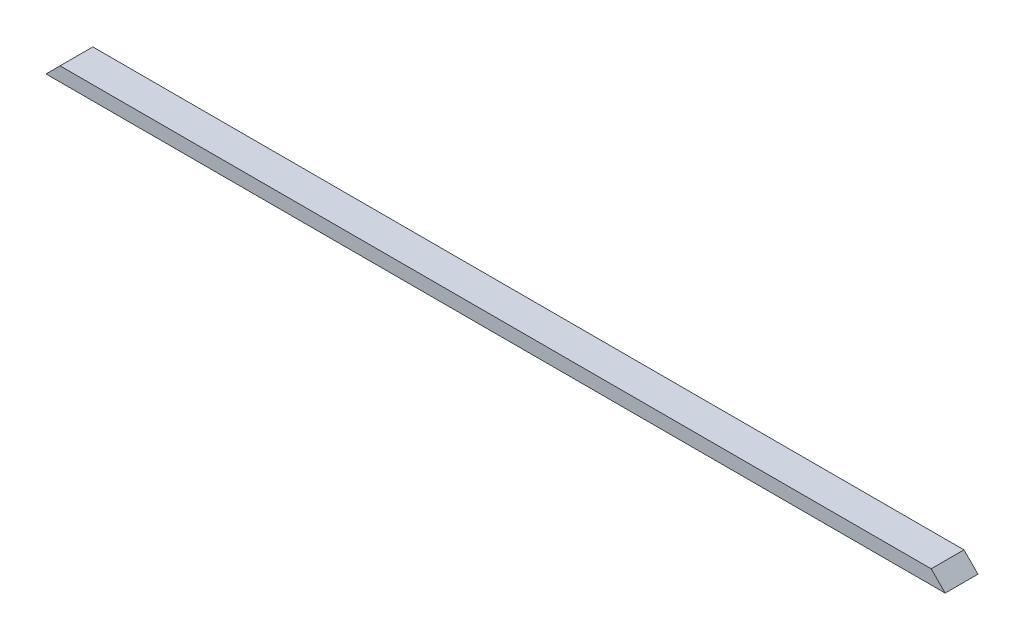
ISO-10303-21;
HEADER;
FILE_DESCRIPTION(('STEP AP214'),'2;1');
FILE_NAME('part.step','',(''),(''),'','','');
FILE_SCHEMA(('AUTOMOTIVE_DESIGN { 1 0 10303 214 1 1 1 1 }'));
ENDSEC;
DATA;
#1=APPLICATION_CONTEXT('core data for automotive mechanical design processes');
#2=APPLICATION_PROTOCOL_DEFINITION('international standard','automotive_design',2000,#1);
#3=PRODUCT_CONTEXT('',#1,'mechanical');
#4=PRODUCT('Part','Part','',(#3));
#5=PRODUCT_RELATED_PRODUCT_CATEGORY('part','',(#4));
#6=PRODUCT_DEFINITION_FORMATION('','',#4);
#7=PRODUCT_DEFINITION_CONTEXT('part definition',#1,'design');
#8=PRODUCT_DEFINITION('design','',#6,#7);
#9=PRODUCT_DEFINITION_SHAPE('','',#8);
#10=(LENGTH_UNIT() NAMED_UNIT(*) SI_UNIT(.MILLI.,.METRE.));
#11=(NAMED_UNIT(*) PLANE_ANGLE_UNIT() SI_UNIT($,.RADIAN.));
#12=(NAMED_UNIT(*) SI_UNIT($,.STERADIAN.) SOLID_ANGLE_UNIT());
#13=UNCERTAINTY_MEASURE_WITH_UNIT(LENGTH_MEASURE(1.E-05),#10,'distance_accuracy_value','');
#14=(GEOMETRIC_REPRESENTATION_CONTEXT(3) GLOBAL_UNCERTAINTY_ASSIGNED_CONTEXT((#13)) GLOBAL_UNIT_ASSIGNED_CONTEXT((#10,
#11,#12)) REPRESENTATION_CONTEXT('',''));
#15=CARTESIAN_POINT('',(0.,0.,0.));
#16=DIRECTION('',(0.,0.,1.));
#17=DIRECTION('',(1.,0.,0.));
#18=AXIS2_PLACEMENT_3D('',#15,#16,#17);
#19=CARTESIAN_POINT('',(0.,38.1,0.));
#20=DIRECTION('',(0.,0.,-1.));
#21=DIRECTION('',(-1.,0.,0.));
#22=AXIS2_PLACEMENT_3D('',#19,#20,#21);
#23=PLANE('',#22);
#24=DIRECTION('',(1.,0.,0.));
#25=VECTOR('',#24,1.);
#26=CARTESIAN_POINT('',(0.,38.1,0.));
#27=LINE('',#26,#25);
#28=CARTESIAN_POINT('',(38.1,38.1,0.));
#29=VERTEX_POINT('',#28);
#30=CARTESIAN_POINT('',(2400.3,38.1,0.));
#31=VERTEX_POINT('',#30);
#32=EDGE_CURVE('E47',#29,#31,#27,.T.);
#33=ORIENTED_EDGE('',*,*,#32,.F.);
#34=DIRECTION('',(0.707106781186547,0.707106781186547,0.));
#35=VECTOR('',#34,1.);
#36=CARTESIAN_POINT('',(0.,0.,0.));
#37=LINE('',#36,#35);
#38=CARTESIAN_POINT('',(0.,0.,0.));
#39=VERTEX_POINT('',#38);
#40=EDGE_CURVE('E82',#39,#29,#37,.T.);
#41=ORIENTED_EDGE('',*,*,#40,.F.);
#42=DIRECTION('',(1.,0.,0.));
#43=VECTOR('',#42,1.);
#44=CARTESIAN_POINT('',(0.,0.,0.));
#45=LINE('',#44,#43);
#46=CARTESIAN_POINT('',(2438.4,0.,0.));
#47=VERTEX_POINT('',#46);
#48=EDGE_CURVE('E87',#39,#47,#45,.T.);
#49=ORIENTED_EDGE('',*,*,#48,.T.);
#50=DIRECTION('',(0.707106781186548,-0.707106781186547,0.));
#51=VECTOR('',#50,1.);
#52=CARTESIAN_POINT('',(2400.3,38.1,0.));
#53=LINE('',#52,#51);
#54=EDGE_CURVE('E63',#31,#47,#53,.T.);
#55=ORIENTED_EDGE('',*,*,#54,.F.);
#56=EDGE_LOOP('',(#33,#41,#49,#55));
#57=FACE_BOUND('',#56,.T.);
#58=ADVANCED_FACE('F39',(#57),#23,.F.);
#59=CARTESIAN_POINT('',(0.,38.1,-88.9));
#60=DIRECTION('',(0.,0.,1.));
#61=DIRECTION('',(1.,0.,0.));
#62=AXIS2_PLACEMENT_3D('',#59,#60,#61);
#63=PLANE('',#62);
#64=DIRECTION('',(-1.,0.,0.));
#65=VECTOR('',#64,1.);
#66=CARTESIAN_POINT('',(0.,0.,-88.9));
#67=LINE('',#66,#65);
#68=CARTESIAN_POINT('',(2438.4,0.,-88.9));
#69=VERTEX_POINT('',#68);
#70=CARTESIAN_POINT('',(0.,0.,-88.9));
#71=VERTEX_POINT('',#70);
#72=EDGE_CURVE('E42',#69,#71,#67,.T.);
#73=ORIENTED_EDGE('',*,*,#72,.T.);
#74=DIRECTION('',(0.707106781186547,0.707106781186547,0.));
#75=VECTOR('',#74,1.);
#76=CARTESIAN_POINT('',(0.,0.,-88.9));
#77=LINE('',#76,#75);
#78=CARTESIAN_POINT('',(38.1,38.1,-88.9));
#79=VERTEX_POINT('',#78);
#80=EDGE_CURVE('E55',#71,#79,#77,.T.);
#81=ORIENTED_EDGE('',*,*,#80,.T.);
#82=DIRECTION('',(-1.,0.,0.));
#83=VECTOR('',#82,1.);
#84=CARTESIAN_POINT('',(0.,38.1,-88.9));
#85=LINE('',#84,#83);
#86=CARTESIAN_POINT('',(2400.3,38.1,-88.9));
#87=VERTEX_POINT('',#86);
#88=EDGE_CURVE('E11',#87,#79,#85,.T.);
#89=ORIENTED_EDGE('',*,*,#88,.F.);
#90=DIRECTION('',(0.707106781186548,-0.707106781186547,0.));
#91=VECTOR('',#90,1.);
#92=CARTESIAN_POINT('',(2400.3,38.1,-88.9));
#93=LINE('',#92,#91);
#94=EDGE_CURVE('E100',#87,#69,#93,.T.);
#95=ORIENTED_EDGE('',*,*,#94,.T.);
#96=EDGE_LOOP('',(#73,#81,#89,#95));
#97=FACE_BOUND('',#96,.T.);
#98=ADVANCED_FACE('F109',(#97),#63,.F.);
#99=CARTESIAN_POINT('',(0.,38.1,0.));
#100=DIRECTION('',(0.,-1.,0.));
#101=DIRECTION('',(0.,0.,-1.));
#102=AXIS2_PLACEMENT_3D('',#99,#100,#101);
#103=PLANE('',#102);
#104=ORIENTED_EDGE('',*,*,#88,.T.);
#105=DIRECTION('',(0.,0.,1.));
#106=VECTOR('',#105,1.);
#107=CARTESIAN_POINT('',(38.1,38.1,-88.9));
#108=LINE('',#107,#106);
#109=EDGE_CURVE('E88',#79,#29,#108,.T.);
#110=ORIENTED_EDGE('',*,*,#109,.T.);
#111=ORIENTED_EDGE('',*,*,#32,.T.);
#112=DIRECTION('',(0.,0.,1.));
#113=VECTOR('',#112,1.);
#114=CARTESIAN_POINT('',(2400.3,38.1,-88.9));
#115=LINE('',#114,#113);
#116=EDGE_CURVE('E103',#87,#31,#115,.T.);
#117=ORIENTED_EDGE('',*,*,#116,.F.);
#118=EDGE_LOOP('',(#104,#110,#111,#117));
#119=FACE_BOUND('',#118,.T.);
#120=ADVANCED_FACE('F112',(#119),#103,.F.);
#121=CARTESIAN_POINT('',(0.,0.,0.));
#122=DIRECTION('',(0.,-1.,0.));
#123=DIRECTION('',(0.,0.,-1.));
#124=AXIS2_PLACEMENT_3D('',#121,#122,#123);
#125=PLANE('',#124);
#126=DIRECTION('',(0.,0.,1.));
#127=VECTOR('',#126,1.);
#128=CARTESIAN_POINT('',(0.,0.,0.));
#129=LINE('',#128,#127);
#130=EDGE_CURVE('E79',#71,#39,#129,.T.);
#131=ORIENTED_EDGE('',*,*,#130,.F.);
#132=ORIENTED_EDGE('',*,*,#72,.F.);
#133=DIRECTION('',(0.,0.,-1.));
#134=VECTOR('',#133,1.);
#135=CARTESIAN_POINT('',(2438.4,0.,0.));
#136=LINE('',#135,#134);
#137=EDGE_CURVE('E96',#47,#69,#136,.T.);
#138=ORIENTED_EDGE('',*,*,#137,.F.);
#139=ORIENTED_EDGE('',*,*,#48,.F.);
#140=EDGE_LOOP('',(#131,#132,#138,#139));
#141=FACE_BOUND('',#140,.T.);
#142=ADVANCED_FACE('F95',(#141),#125,.T.);
#143=CARTESIAN_POINT('',(2400.3,38.1,-88.9));
#144=DIRECTION('',(-0.707106781186547,-0.707106781186548,0.));
#145=DIRECTION('',(0.707106781186548,-0.707106781186547,0.));
#146=AXIS2_PLACEMENT_3D('',#143,#144,#145);
#147=PLANE('',#146);
#148=ORIENTED_EDGE('',*,*,#54,.T.);
#149=ORIENTED_EDGE('',*,*,#137,.T.);
#150=ORIENTED_EDGE('',*,*,#94,.F.);
#151=ORIENTED_EDGE('',*,*,#116,.T.);
#152=EDGE_LOOP('',(#148,#149,#150,#151));
#153=FACE_BOUND('',#152,.T.);
#154=ADVANCED_FACE('F113',(#153),#147,.F.);
#155=CARTESIAN_POINT('',(0.,0.,-88.9));
#156=DIRECTION('',(0.707106781186547,-0.707106781186547,0.));
#157=DIRECTION('',(0.707106781186548,0.707106781186548,0.));
#158=AXIS2_PLACEMENT_3D('',#155,#156,#157);
#159=PLANE('',#158);
#160=ORIENTED_EDGE('',*,*,#40,.T.);
#161=ORIENTED_EDGE('',*,*,#109,.F.);
#162=ORIENTED_EDGE('',*,*,#80,.F.);
#163=ORIENTED_EDGE('',*,*,#130,.T.);
#164=EDGE_LOOP('',(#160,#161,#162,#163));
#165=FACE_BOUND('',#164,.T.);
#166=ADVANCED_FACE('F81',(#165),#159,.F.);
#167=CLOSED_SHELL('',(#58,#98,#120,#142,#154,#166));
#168=MANIFOLD_SOLID_BREP('B2',#167);
#169=ADVANCED_BREP_SHAPE_REPRESENTATION('',(#18,#168),#14);
#170=SHAPE_DEFINITION_REPRESENTATION(#9,#169);
ENDSEC;
END-ISO-10303-21;
